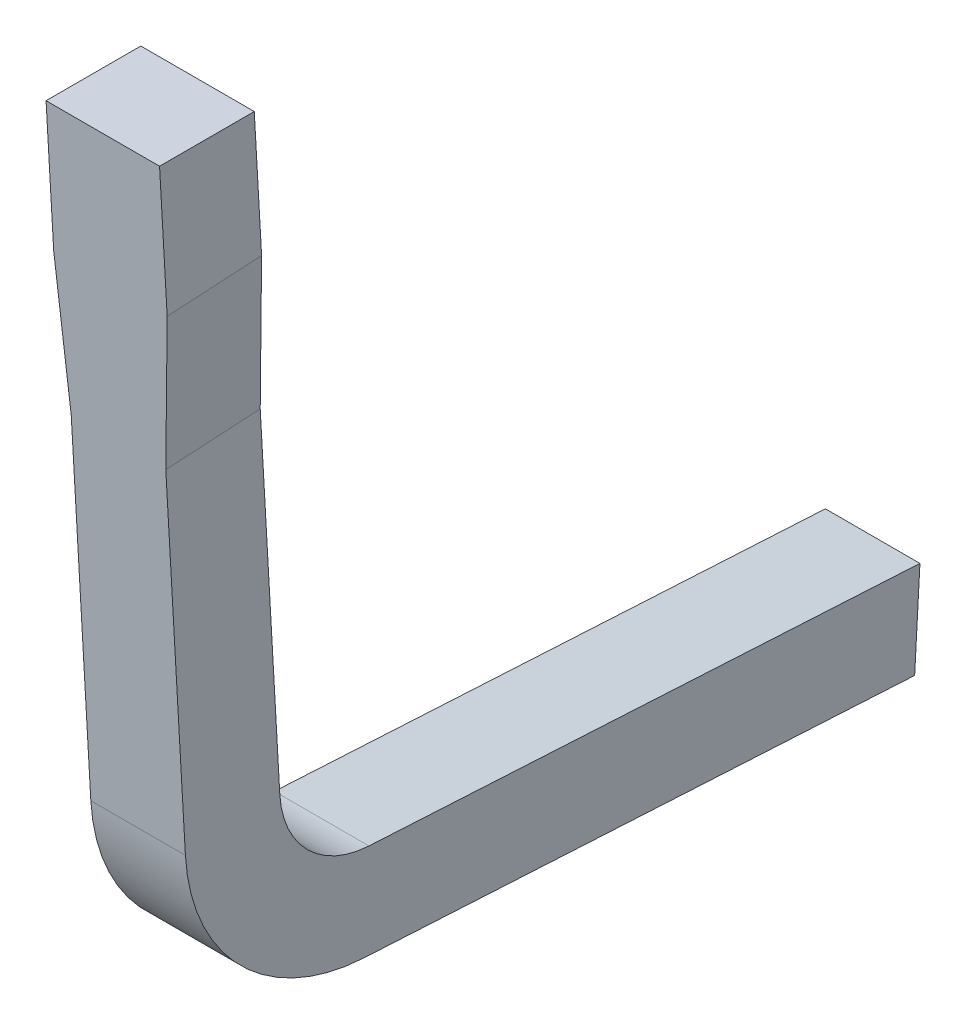
ISO-10303-21;
HEADER;
FILE_DESCRIPTION(('STEP AP214'),'2;1');
FILE_NAME('part.step','',(''),(''),'','','');
FILE_SCHEMA(('AUTOMOTIVE_DESIGN { 1 0 10303 214 1 1 1 1 }'));
ENDSEC;
DATA;
#1=APPLICATION_CONTEXT('core data for automotive mechanical design processes');
#2=APPLICATION_PROTOCOL_DEFINITION('international standard','automotive_design',2000,#1);
#3=PRODUCT_CONTEXT('',#1,'mechanical');
#4=PRODUCT('Part','Part','',(#3));
#5=PRODUCT_RELATED_PRODUCT_CATEGORY('part','',(#4));
#6=PRODUCT_DEFINITION_FORMATION('','',#4);
#7=PRODUCT_DEFINITION_CONTEXT('part definition',#1,'design');
#8=PRODUCT_DEFINITION('design','',#6,#7);
#9=PRODUCT_DEFINITION_SHAPE('','',#8);
#10=(LENGTH_UNIT() NAMED_UNIT(*) SI_UNIT(.MILLI.,.METRE.));
#11=(NAMED_UNIT(*) PLANE_ANGLE_UNIT() SI_UNIT($,.RADIAN.));
#12=(NAMED_UNIT(*) SI_UNIT($,.STERADIAN.) SOLID_ANGLE_UNIT());
#13=UNCERTAINTY_MEASURE_WITH_UNIT(LENGTH_MEASURE(1.E-05),#10,'distance_accuracy_value','');
#14=(GEOMETRIC_REPRESENTATION_CONTEXT(3) GLOBAL_UNCERTAINTY_ASSIGNED_CONTEXT((#13)) GLOBAL_UNIT_ASSIGNED_CONTEXT((#10,
#11,#12)) REPRESENTATION_CONTEXT('',''));
#15=CARTESIAN_POINT('',(0.,0.,0.));
#16=DIRECTION('',(0.,0.,1.));
#17=DIRECTION('',(1.,0.,0.));
#18=AXIS2_PLACEMENT_3D('',#15,#16,#17);
#19=CARTESIAN_POINT('',(-3.12,-1.879082198882,-10.32387202233));
#20=DIRECTION('',(1.,0.,0.));
#21=DIRECTION('',(0.,0.,-1.));
#22=AXIS2_PLACEMENT_3D('',#19,#20,#21);
#23=PLANE('',#22);
#24=DIRECTION('',(1.77809156290928E-13,-0.0569406083160486,0.998377567418559));
#25=VECTOR('',#24,1.);
#26=CARTESIAN_POINT('',(-3.12,-2.014836222708,-10.43177700759));
#27=LINE('',#26,#25);
#28=CARTESIAN_POINT('',(-3.12,-2.01483622270796,-10.4317770075908));
#29=VERTEX_POINT('',#28);
#30=CARTESIAN_POINT('',(-3.11999999999999,-2.02622434437119,-10.2321014941066));
#31=VERTEX_POINT('',#30);
#32=EDGE_CURVE('E183',#29,#31,#27,.T.);
#33=ORIENTED_EDGE('',*,*,#32,.T.);
#34=DIRECTION('',(0.,-0.998377567418999,-0.0569406083083299));
#35=VECTOR('',#34,1.);
#36=CARTESIAN_POINT('',(-3.12,-2.398052209196,-10.25330800505));
#37=LINE('',#36,#35);
#38=CARTESIAN_POINT('',(-3.12,-1.74332817505504,-10.2159670370689));
#39=VERTEX_POINT('',#38);
#40=EDGE_CURVE('E180',#39,#31,#37,.T.);
#41=ORIENTED_EDGE('',*,*,#40,.F.);
#42=DIRECTION('',(0.,0.,1.));
#43=VECTOR('',#42,1.);
#44=CARTESIAN_POINT('',(-3.12,-1.743328175055,-10.31612954398));
#45=LINE('',#44,#43);
#46=CARTESIAN_POINT('',(-3.12,-1.74332817505473,-10.4162920508947));
#47=VERTEX_POINT('',#46);
#48=EDGE_CURVE('E175',#47,#39,#45,.T.);
#49=ORIENTED_EDGE('',*,*,#48,.F.);
#50=DIRECTION('',(0.,-0.998377567418624,-0.0569406083148914));
#51=VECTOR('',#50,1.);
#52=CARTESIAN_POINT('',(-3.12,-2.392358148368,-10.45330826871));
#53=LINE('',#52,#51);
#54=EDGE_CURVE('E205',#47,#29,#53,.T.);
#55=ORIENTED_EDGE('',*,*,#54,.T.);
#56=EDGE_LOOP('',(#33,#41,#49,#55));
#57=FACE_BOUND('',#56,.T.);
#58=ADVANCED_FACE('F17',(#57),#23,.F.);
#59=CARTESIAN_POINT('',(-3.11,-2.170286918652,-10.3404803421));
#60=DIRECTION('',(0.997785157856611,0.0664110879137907,0.00378763292362404));
#61=DIRECTION('',(-0.0664115642910679,0.99779231512796,0.));
#62=AXIS2_PLACEMENT_3D('',#59,#60,#61);
#63=PLANE('',#62);
#64=DIRECTION('',(0.0665190105237393,-0.996166318707665,-0.0568144938493813));
#65=VECTOR('',#64,1.);
#66=CARTESIAN_POINT('',(-3.12,-2.02622434437119,-10.2321014941066));
#67=LINE('',#66,#65);
#68=CARTESIAN_POINT('',(-3.1,-2.32573761459706,-10.2491836765991));
#69=VERTEX_POINT('',#68);
#70=EDGE_CURVE('E161',#31,#69,#67,.T.);
#71=ORIENTED_EDGE('',*,*,#70,.F.);
#72=ORIENTED_EDGE('',*,*,#32,.F.);
#73=DIRECTION('',(0.0665190105237394,-0.996166318707292,-0.0568144938559241));
#74=VECTOR('',#73,1.);
#75=CARTESIAN_POINT('',(-3.12,-2.01483622270793,-10.4317770075911));
#76=LINE('',#75,#74);
#77=CARTESIAN_POINT('',(-3.1,-2.31434949293379,-10.4488591900838));
#78=VERTEX_POINT('',#77);
#79=EDGE_CURVE('E115',#29,#78,#76,.T.);
#80=ORIENTED_EDGE('',*,*,#79,.T.);
#81=DIRECTION('',(0.,-0.0569406083160594,0.998377567418558));
#82=VECTOR('',#81,1.);
#83=CARTESIAN_POINT('',(-3.1,-2.314349492934,-10.44885919008));
#84=LINE('',#83,#82);
#85=EDGE_CURVE('E110',#78,#69,#84,.T.);
#86=ORIENTED_EDGE('',*,*,#85,.T.);
#87=EDGE_LOOP('',(#71,#72,#80,#86));
#88=FACE_BOUND('',#87,.T.);
#89=ADVANCED_FACE('F288',(#88),#63,.F.);
#90=CARTESIAN_POINT('',(-2.88,-1.879082198882,-10.32387202233));
#91=DIRECTION('',(1.,0.,0.));
#92=DIRECTION('',(0.,0.,-1.));
#93=AXIS2_PLACEMENT_3D('',#90,#91,#92);
#94=PLANE('',#93);
#95=DIRECTION('',(0.,-0.998377567418624,-0.0569406083148914));
#96=VECTOR('',#95,1.);
#97=CARTESIAN_POINT('',(-2.88,-2.392358148368,-10.45330826871));
#98=LINE('',#97,#96);
#99=CARTESIAN_POINT('',(-2.87999999999998,-2.01483622270898,-10.4317770075904));
#100=VERTEX_POINT('',#99);
#101=CARTESIAN_POINT('',(-2.88,-1.74332817505473,-10.4162920508947));
#102=VERTEX_POINT('',#101);
#103=EDGE_CURVE('E128',#100,#102,#98,.F.);
#104=ORIENTED_EDGE('',*,*,#103,.T.);
#105=DIRECTION('',(0.,0.,1.));
#106=VECTOR('',#105,1.);
#107=CARTESIAN_POINT('',(-2.88,-1.743328175055,-10.31612954398));
#108=LINE('',#107,#106);
#109=CARTESIAN_POINT('',(-2.88,-1.74332817505504,-10.2159670370692));
#110=VERTEX_POINT('',#109);
#111=EDGE_CURVE('E185',#110,#102,#108,.F.);
#112=ORIENTED_EDGE('',*,*,#111,.F.);
#113=DIRECTION('',(0.,-0.998377567418999,-0.0569406083083299));
#114=VECTOR('',#113,1.);
#115=CARTESIAN_POINT('',(-2.88,-2.398052209196,-10.25330800505));
#116=LINE('',#115,#114);
#117=CARTESIAN_POINT('',(-2.87999999999999,-2.02622434437119,-10.2321014941066));
#118=VERTEX_POINT('',#117);
#119=EDGE_CURVE('E168',#118,#110,#116,.F.);
#120=ORIENTED_EDGE('',*,*,#119,.F.);
#121=DIRECTION('',(0.,-0.0569406083110731,0.998377567418842));
#122=VECTOR('',#121,1.);
#123=CARTESIAN_POINT('',(-2.87999999999997,-2.014836222709,-10.43177700759));
#124=LINE('',#123,#122);
#125=EDGE_CURVE('E131',#100,#118,#124,.T.);
#126=ORIENTED_EDGE('',*,*,#125,.F.);
#127=EDGE_LOOP('',(#104,#112,#120,#126));
#128=FACE_BOUND('',#127,.T.);
#129=ADVANCED_FACE('F251',(#128),#94,.T.);
#130=CARTESIAN_POINT('',(-3.,-1.743328175055,-10.31612954398));
#131=DIRECTION('',(0.,1.,0.));
#132=DIRECTION('',(0.,0.,1.));
#133=AXIS2_PLACEMENT_3D('',#130,#131,#132);
#134=PLANE('',#133);
#135=DIRECTION('',(1.,0.,0.));
#136=VECTOR('',#135,1.);
#137=CARTESIAN_POINT('',(-3.,-1.74332817505459,-10.4162920508971));
#138=LINE('',#137,#136);
#139=EDGE_CURVE('E138',#102,#47,#138,.F.);
#140=ORIENTED_EDGE('',*,*,#139,.T.);
#141=ORIENTED_EDGE('',*,*,#48,.T.);
#142=DIRECTION('',(1.,0.,0.));
#143=VECTOR('',#142,1.);
#144=CARTESIAN_POINT('',(-3.,-1.74332817505506,-10.2159670370689));
#145=LINE('',#144,#143);
#146=EDGE_CURVE('E171',#110,#39,#145,.F.);
#147=ORIENTED_EDGE('',*,*,#146,.F.);
#148=ORIENTED_EDGE('',*,*,#111,.T.);
#149=EDGE_LOOP('',(#140,#141,#147,#148));
#150=FACE_BOUND('',#149,.T.);
#151=ADVANCED_FACE('F291',(#150),#134,.T.);
#152=CARTESIAN_POINT('',(-3.1,-2.898875732105,-11.04167004462));
#153=DIRECTION('',(1.,0.,0.));
#154=DIRECTION('',(0.,0.,-1.));
#155=AXIS2_PLACEMENT_3D('',#152,#153,#154);
#156=PLANE('',#155);
#157=CARTESIAN_POINT('',(-3.1,-3.03,-10.69));
#158=DIRECTION('',(-1.,0.,0.));
#159=DIRECTION('',(0.,0.,1.));
#160=AXIS2_PLACEMENT_3D('',#157,#158,#159);
#161=CIRCLE('',#160,0.4);
#162=CARTESIAN_POINT('',(-3.1,-3.05277624332116,-10.2906489730313));
#163=VERTEX_POINT('',#162);
#164=CARTESIAN_POINT('',(-3.1,-3.42937693582933,-10.6676826720305));
#165=VERTEX_POINT('',#164);
#166=EDGE_CURVE('E155',#163,#165,#161,.F.);
#167=ORIENTED_EDGE('',*,*,#166,.F.);
#168=DIRECTION('',(0.,-0.998377567418999,-0.0569406083083299));
#169=VECTOR('',#168,1.);
#170=CARTESIAN_POINT('',(-3.1,-2.398052209196,-10.25330800505));
#171=LINE('',#170,#169);
#172=EDGE_CURVE('E158',#69,#163,#171,.T.);
#173=ORIENTED_EDGE('',*,*,#172,.F.);
#174=ORIENTED_EDGE('',*,*,#85,.F.);
#175=DIRECTION('',(0.,-0.998377567418624,-0.0569406083148914));
#176=VECTOR('',#175,1.);
#177=CARTESIAN_POINT('',(-3.1,-2.392358148368,-10.45330826871));
#178=LINE('',#177,#176);
#179=CARTESIAN_POINT('',(-3.1,-3.0413881216286,-10.4903244865199));
#180=VERTEX_POINT('',#179);
#181=EDGE_CURVE('E104',#78,#180,#178,.T.);
#182=ORIENTED_EDGE('',*,*,#181,.T.);
#183=CARTESIAN_POINT('',(-3.1,-3.03,-10.69));
#184=DIRECTION('',(-1.,0.,0.));
#185=DIRECTION('',(0.,0.,1.));
#186=AXIS2_PLACEMENT_3D('',#183,#184,#185);
#187=CIRCLE('',#186,0.2);
#188=CARTESIAN_POINT('',(-3.1,-3.22968846791482,-10.6788413360177));
#189=VERTEX_POINT('',#188);
#190=EDGE_CURVE('E20',#180,#189,#187,.F.);
#191=ORIENTED_EDGE('',*,*,#190,.T.);
#192=DIRECTION('',(0.,0.0557933199228295,0.998442339572991));
#193=VECTOR('',#192,1.);
#194=CARTESIAN_POINT('',(-3.1,-3.262244863925,-11.26145022621));
#195=LINE('',#194,#193);
#196=CARTESIAN_POINT('',(-3.1,-3.29480125993501,-11.8440591164004));
#197=VERTEX_POINT('',#196);
#198=EDGE_CURVE('E123',#197,#189,#195,.T.);
#199=ORIENTED_EDGE('',*,*,#198,.F.);
#200=DIRECTION('',(0.,-0.998442339574031,0.0557933199042218));
#201=VECTOR('',#200,1.);
#202=CARTESIAN_POINT('',(-3.1,-3.394645493892,-11.83847978441));
#203=LINE('',#202,#201);
#204=CARTESIAN_POINT('',(-3.1,-3.49448972784906,-11.8329004524196));
#205=VERTEX_POINT('',#204);
#206=EDGE_CURVE('E148',#197,#205,#203,.T.);
#207=ORIENTED_EDGE('',*,*,#206,.T.);
#208=DIRECTION('',(0.,0.055793319922371,0.998442339573017));
#209=VECTOR('',#208,1.);
#210=CARTESIAN_POINT('',(-3.1,-3.461933331839,-11.25029156222));
#211=LINE('',#210,#209);
#212=EDGE_CURVE('E153',#205,#165,#211,.T.);
#213=ORIENTED_EDGE('',*,*,#212,.T.);
#214=EDGE_LOOP('',(#167,#173,#174,#182,#191,#199,#207,#213));
#215=FACE_BOUND('',#214,.T.);
#216=ADVANCED_FACE('F107',(#215),#156,.F.);
#217=CARTESIAN_POINT('',(-3.,-3.262244863925,-11.26145022621));
#218=DIRECTION('',(0.,0.998442339572991,-0.0557933199228295));
#219=DIRECTION('',(0.,0.0557933199228295,0.998442339572991));
#220=AXIS2_PLACEMENT_3D('',#217,#218,#219);
#221=PLANE('',#220);
#222=DIRECTION('',(0.,0.055793319922887,0.998442339572988));
#223=VECTOR('',#222,1.);
#224=CARTESIAN_POINT('',(-2.9,-3.294801259935,-11.8440591164));
#225=LINE('',#224,#223);
#226=CARTESIAN_POINT('',(-2.9,-3.29480125993501,-11.8440591164001));
#227=VERTEX_POINT('',#226);
#228=CARTESIAN_POINT('',(-2.9,-3.2296884679148,-10.6788413360177));
#229=VERTEX_POINT('',#228);
#230=EDGE_CURVE('E142',#227,#229,#225,.T.);
#231=ORIENTED_EDGE('',*,*,#230,.F.);
#232=DIRECTION('',(1.,0.,0.));
#233=VECTOR('',#232,1.);
#234=CARTESIAN_POINT('',(-3.,-3.29480125993502,-11.8440591164004));
#235=LINE('',#234,#233);
#236=EDGE_CURVE('E139',#227,#197,#235,.F.);
#237=ORIENTED_EDGE('',*,*,#236,.T.);
#238=ORIENTED_EDGE('',*,*,#198,.T.);
#239=DIRECTION('',(-1.,0.,0.));
#240=VECTOR('',#239,1.);
#241=CARTESIAN_POINT('',(-2.896,-3.22968846791485,-10.67884133602));
#242=LINE('',#241,#240);
#243=EDGE_CURVE('E122',#189,#229,#242,.F.);
#244=ORIENTED_EDGE('',*,*,#243,.T.);
#245=EDGE_LOOP('',(#231,#237,#238,#244));
#246=FACE_BOUND('',#245,.T.);
#247=ADVANCED_FACE('F284',(#246),#221,.T.);
#248=CARTESIAN_POINT('',(-2.896,-3.03,-10.69));
#249=DIRECTION('',(-1.,0.,0.));
#250=DIRECTION('',(0.,0.,1.));
#251=AXIS2_PLACEMENT_3D('',#248,#249,#250);
#252=CYLINDRICAL_SURFACE('',#251,0.2);
#253=ORIENTED_EDGE('',*,*,#190,.F.);
#254=DIRECTION('',(1.,0.,0.));
#255=VECTOR('',#254,1.);
#256=CARTESIAN_POINT('',(-3.,-3.04138812159455,-10.4903244865179));
#257=LINE('',#256,#255);
#258=CARTESIAN_POINT('',(-2.9,-3.04138812162905,-10.4903244865184));
#259=VERTEX_POINT('',#258);
#260=EDGE_CURVE('E114',#180,#259,#257,.T.);
#261=ORIENTED_EDGE('',*,*,#260,.T.);
#262=CARTESIAN_POINT('',(-2.9,-3.03,-10.69));
#263=DIRECTION('',(-1.,0.,0.));
#264=DIRECTION('',(0.,0.,1.));
#265=AXIS2_PLACEMENT_3D('',#262,#263,#264);
#266=CIRCLE('',#265,0.2);
#267=EDGE_CURVE('E223',#229,#259,#266,.T.);
#268=ORIENTED_EDGE('',*,*,#267,.F.);
#269=ORIENTED_EDGE('',*,*,#243,.F.);
#270=EDGE_LOOP('',(#253,#261,#268,#269));
#271=FACE_BOUND('',#270,.T.);
#272=ADVANCED_FACE('F119',(#271),#252,.F.);
#273=CARTESIAN_POINT('',(-3.,-2.392358148368,-10.45330826871));
#274=DIRECTION('',(0.,-0.0569406083148914,0.998377567418624));
#275=DIRECTION('',(0.,-0.998377567418624,-0.0569406083148914));
#276=AXIS2_PLACEMENT_3D('',#273,#274,#275);
#277=PLANE('',#276);
#278=DIRECTION('',(0.0665190105240593,0.996166318708109,0.0568144938412267));
#279=VECTOR('',#278,1.);
#280=CARTESIAN_POINT('',(-2.9,-2.314349492934,-10.44885919008));
#281=LINE('',#280,#279);
#282=CARTESIAN_POINT('',(-2.9,-2.314349492934,-10.44885919008));
#283=VERTEX_POINT('',#282);
#284=EDGE_CURVE('E165',#283,#100,#281,.T.);
#285=ORIENTED_EDGE('',*,*,#284,.F.);
#286=DIRECTION('',(0.,0.998377567418421,0.0569406083184697));
#287=VECTOR('',#286,1.);
#288=CARTESIAN_POINT('',(-2.9,-3.041388121684,-10.49032448652));
#289=LINE('',#288,#287);
#290=EDGE_CURVE('E126',#259,#283,#289,.T.);
#291=ORIENTED_EDGE('',*,*,#290,.F.);
#292=ORIENTED_EDGE('',*,*,#260,.F.);
#293=ORIENTED_EDGE('',*,*,#181,.F.);
#294=ORIENTED_EDGE('',*,*,#79,.F.);
#295=ORIENTED_EDGE('',*,*,#54,.F.);
#296=ORIENTED_EDGE('',*,*,#139,.F.);
#297=ORIENTED_EDGE('',*,*,#103,.F.);
#298=EDGE_LOOP('',(#285,#291,#292,#293,#294,#295,#296,#297));
#299=FACE_BOUND('',#298,.T.);
#300=ADVANCED_FACE('F124',(#299),#277,.F.);
#301=CARTESIAN_POINT('',(-2.89,-2.170286918653,-10.34048034209));
#302=DIRECTION('',(0.99778515785659,-0.0664110879141193,-0.00378763292348296));
#303=DIRECTION('',(0.0664115642913965,0.997792315127938,0.));
#304=AXIS2_PLACEMENT_3D('',#301,#302,#303);
#305=PLANE('',#304);
#306=DIRECTION('',(0.,-0.0569406083160594,0.998377567418558));
#307=VECTOR('',#306,1.);
#308=CARTESIAN_POINT('',(-2.9,-2.314349492934,-10.44885919008));
#309=LINE('',#308,#307);
#310=CARTESIAN_POINT('',(-2.9,-2.32573761459702,-10.2491836765997));
#311=VERTEX_POINT('',#310);
#312=EDGE_CURVE('E238',#283,#311,#309,.T.);
#313=ORIENTED_EDGE('',*,*,#312,.F.);
#314=ORIENTED_EDGE('',*,*,#284,.T.);
#315=ORIENTED_EDGE('',*,*,#125,.T.);
#316=DIRECTION('',(0.0665190105237393,0.996166318707665,0.0568144938493813));
#317=VECTOR('',#316,1.);
#318=CARTESIAN_POINT('',(-2.9,-2.32573761459705,-10.2491836765991));
#319=LINE('',#318,#317);
#320=EDGE_CURVE('E160',#311,#118,#319,.T.);
#321=ORIENTED_EDGE('',*,*,#320,.F.);
#322=EDGE_LOOP('',(#313,#314,#315,#321));
#323=FACE_BOUND('',#322,.T.);
#324=ADVANCED_FACE('F245',(#323),#305,.T.);
#325=CARTESIAN_POINT('',(-3.,-2.398052209196,-10.25330800505));
#326=DIRECTION('',(0.,-0.0569406083083299,0.998377567418999));
#327=DIRECTION('',(0.,-0.998377567418999,-0.0569406083083299));
#328=AXIS2_PLACEMENT_3D('',#325,#326,#327);
#329=PLANE('',#328);
#330=ORIENTED_EDGE('',*,*,#119,.T.);
#331=ORIENTED_EDGE('',*,*,#146,.T.);
#332=ORIENTED_EDGE('',*,*,#40,.T.);
#333=ORIENTED_EDGE('',*,*,#70,.T.);
#334=ORIENTED_EDGE('',*,*,#172,.T.);
#335=DIRECTION('',(-1.,0.,0.));
#336=VECTOR('',#335,1.);
#337=CARTESIAN_POINT('',(-2.896,-3.05277624331888,-10.2906489730321));
#338=LINE('',#337,#336);
#339=CARTESIAN_POINT('',(-2.9,-3.05277624332089,-10.2906489730312));
#340=VERTEX_POINT('',#339);
#341=EDGE_CURVE('E198',#340,#163,#338,.T.);
#342=ORIENTED_EDGE('',*,*,#341,.F.);
#343=DIRECTION('',(0.,-0.998377567419076,-0.0569406083069694));
#344=VECTOR('',#343,1.);
#345=CARTESIAN_POINT('',(-2.9,-2.325737614597,-10.2491836766));
#346=LINE('',#345,#344);
#347=EDGE_CURVE('E222',#311,#340,#346,.T.);
#348=ORIENTED_EDGE('',*,*,#347,.F.);
#349=ORIENTED_EDGE('',*,*,#320,.T.);
#350=EDGE_LOOP('',(#330,#331,#332,#333,#334,#342,#348,#349));
#351=FACE_BOUND('',#350,.T.);
#352=ADVANCED_FACE('F255',(#351),#329,.T.);
#353=CARTESIAN_POINT('',(-2.896,-3.03,-10.69));
#354=DIRECTION('',(-1.,0.,0.));
#355=DIRECTION('',(0.,0.,1.));
#356=AXIS2_PLACEMENT_3D('',#353,#354,#355);
#357=CYLINDRICAL_SURFACE('',#356,0.4);
#358=DIRECTION('',(1.,0.,0.));
#359=VECTOR('',#358,1.);
#360=CARTESIAN_POINT('',(-3.,-3.4293769358293,-10.66768267203));
#361=LINE('',#360,#359);
#362=CARTESIAN_POINT('',(-2.9,-3.42937693582946,-10.6676826720306));
#363=VERTEX_POINT('',#362);
#364=EDGE_CURVE('E150',#165,#363,#361,.T.);
#365=ORIENTED_EDGE('',*,*,#364,.T.);
#366=CARTESIAN_POINT('',(-2.9,-3.03,-10.69));
#367=DIRECTION('',(-1.,0.,0.));
#368=DIRECTION('',(0.,0.,1.));
#369=AXIS2_PLACEMENT_3D('',#366,#367,#368);
#370=CIRCLE('',#369,0.4);
#371=EDGE_CURVE('E219',#340,#363,#370,.F.);
#372=ORIENTED_EDGE('',*,*,#371,.F.);
#373=ORIENTED_EDGE('',*,*,#341,.T.);
#374=ORIENTED_EDGE('',*,*,#166,.T.);
#375=EDGE_LOOP('',(#365,#372,#373,#374));
#376=FACE_BOUND('',#375,.T.);
#377=ADVANCED_FACE('F273',(#376),#357,.T.);
#378=CARTESIAN_POINT('',(-3.,-3.461933331839,-11.25029156222));
#379=DIRECTION('',(0.,0.998442339573017,-0.055793319922371));
#380=DIRECTION('',(0.,0.055793319922371,0.998442339573017));
#381=AXIS2_PLACEMENT_3D('',#378,#379,#380);
#382=PLANE('',#381);
#383=ORIENTED_EDGE('',*,*,#364,.F.);
#384=ORIENTED_EDGE('',*,*,#212,.F.);
#385=DIRECTION('',(1.,0.,0.));
#386=VECTOR('',#385,1.);
#387=CARTESIAN_POINT('',(-3.,-3.49448972784898,-11.8329004524196));
#388=LINE('',#387,#386);
#389=CARTESIAN_POINT('',(-2.9,-3.49448972784899,-11.8329004524199));
#390=VERTEX_POINT('',#389);
#391=EDGE_CURVE('E35',#205,#390,#388,.T.);
#392=ORIENTED_EDGE('',*,*,#391,.T.);
#393=DIRECTION('',(0.,-0.0557933199219327,-0.998442339573042));
#394=VECTOR('',#393,1.);
#395=CARTESIAN_POINT('',(-2.9,-3.429376935829,-10.66768267202));
#396=LINE('',#395,#394);
#397=EDGE_CURVE('E26',#363,#390,#396,.T.);
#398=ORIENTED_EDGE('',*,*,#397,.F.);
#399=EDGE_LOOP('',(#383,#384,#392,#398));
#400=FACE_BOUND('',#399,.T.);
#401=ADVANCED_FACE('F274',(#400),#382,.F.);
#402=CARTESIAN_POINT('',(-3.,-3.394645493892,-11.83847978441));
#403=DIRECTION('',(0.,0.0557933199042218,0.998442339574031));
#404=DIRECTION('',(0.,-0.998442339574031,0.0557933199042218));
#405=AXIS2_PLACEMENT_3D('',#402,#403,#404);
#406=PLANE('',#405);
#407=DIRECTION('',(0.,0.998442339574254,-0.0557933199002383));
#408=VECTOR('',#407,1.);
#409=CARTESIAN_POINT('',(-2.9,-3.494489727849,-11.83290045242));
#410=LINE('',#409,#408);
#411=EDGE_CURVE('E11',#390,#227,#410,.T.);
#412=ORIENTED_EDGE('',*,*,#411,.F.);
#413=ORIENTED_EDGE('',*,*,#391,.F.);
#414=ORIENTED_EDGE('',*,*,#206,.F.);
#415=ORIENTED_EDGE('',*,*,#236,.F.);
#416=EDGE_LOOP('',(#412,#413,#414,#415));
#417=FACE_BOUND('',#416,.T.);
#418=ADVANCED_FACE('F281',(#417),#406,.F.);
#419=CARTESIAN_POINT('',(-2.9,-2.909472777839,-11.05227927458));
#420=DIRECTION('',(1.,0.,0.));
#421=DIRECTION('',(0.,0.,-1.));
#422=AXIS2_PLACEMENT_3D('',#419,#420,#421);
#423=PLANE('',#422);
#424=ORIENTED_EDGE('',*,*,#397,.T.);
#425=ORIENTED_EDGE('',*,*,#411,.T.);
#426=ORIENTED_EDGE('',*,*,#230,.T.);
#427=ORIENTED_EDGE('',*,*,#267,.T.);
#428=ORIENTED_EDGE('',*,*,#290,.T.);
#429=ORIENTED_EDGE('',*,*,#312,.T.);
#430=ORIENTED_EDGE('',*,*,#347,.T.);
#431=ORIENTED_EDGE('',*,*,#371,.T.);
#432=EDGE_LOOP('',(#424,#425,#426,#427,#428,#429,#430,#431));
#433=FACE_BOUND('',#432,.T.);
#434=ADVANCED_FACE('F260',(#433),#423,.T.);
#435=CLOSED_SHELL('',(#58,#89,#129,#151,#216,#247,#272,#300,#324,#352,#377,#401,#418,#434));
#436=MANIFOLD_SOLID_BREP('B1',#435);
#437=ADVANCED_BREP_SHAPE_REPRESENTATION('',(#18,#436),#14);
#438=SHAPE_DEFINITION_REPRESENTATION(#9,#437);
ENDSEC;
END-ISO-10303-21;
